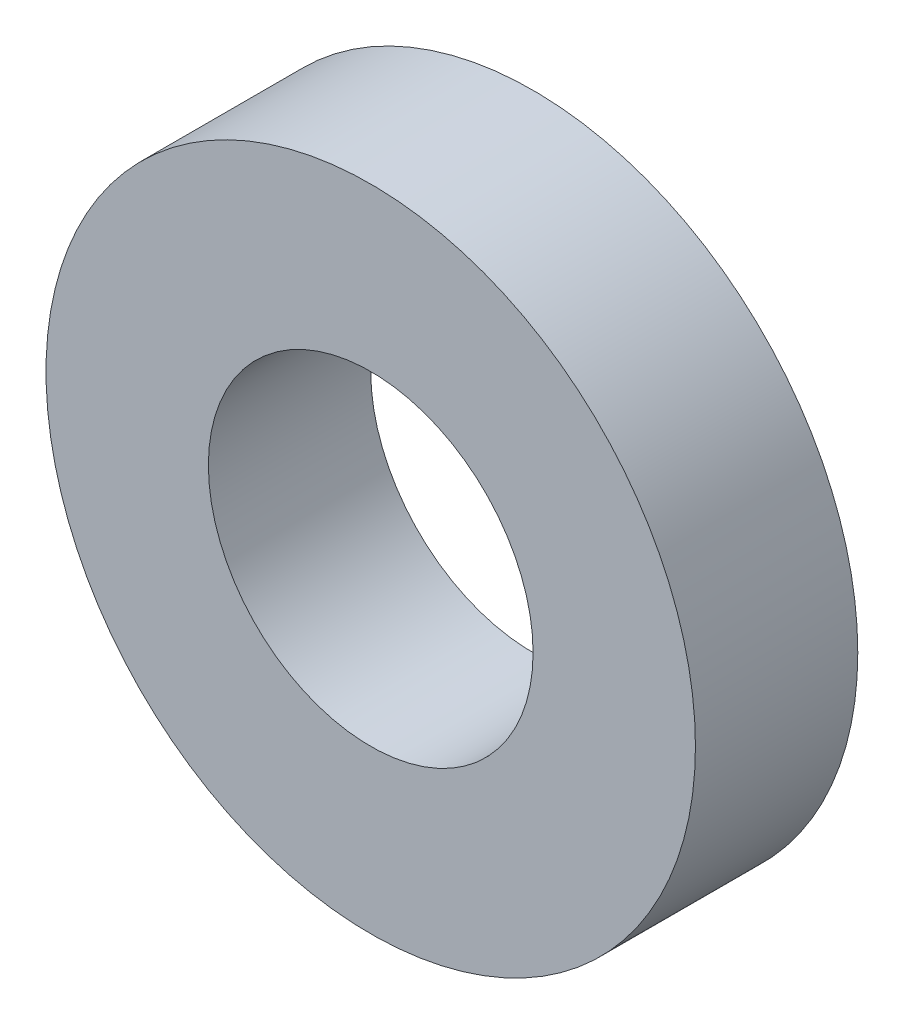
ISO-10303-21;
HEADER;
FILE_DESCRIPTION(('STEP AP214'),'2;1');
FILE_NAME('part.step','',(''),(''),'','','');
FILE_SCHEMA(('AUTOMOTIVE_DESIGN { 1 0 10303 214 1 1 1 1 }'));
ENDSEC;
DATA;
#1=APPLICATION_CONTEXT('core data for automotive mechanical design processes');
#2=APPLICATION_PROTOCOL_DEFINITION('international standard','automotive_design',2000,#1);
#3=PRODUCT_CONTEXT('',#1,'mechanical');
#4=PRODUCT('Part','Part','',(#3));
#5=PRODUCT_RELATED_PRODUCT_CATEGORY('part','',(#4));
#6=PRODUCT_DEFINITION_FORMATION('','',#4);
#7=PRODUCT_DEFINITION_CONTEXT('part definition',#1,'design');
#8=PRODUCT_DEFINITION('design','',#6,#7);
#9=PRODUCT_DEFINITION_SHAPE('','',#8);
#10=(LENGTH_UNIT() NAMED_UNIT(*) SI_UNIT(.MILLI.,.METRE.));
#11=(NAMED_UNIT(*) PLANE_ANGLE_UNIT() SI_UNIT($,.RADIAN.));
#12=(NAMED_UNIT(*) SI_UNIT($,.STERADIAN.) SOLID_ANGLE_UNIT());
#13=UNCERTAINTY_MEASURE_WITH_UNIT(LENGTH_MEASURE(1.E-05),#10,'distance_accuracy_value','');
#14=(GEOMETRIC_REPRESENTATION_CONTEXT(3) GLOBAL_UNCERTAINTY_ASSIGNED_CONTEXT((#13)) GLOBAL_UNIT_ASSIGNED_CONTEXT((#10,
#11,#12)) REPRESENTATION_CONTEXT('',''));
#15=CARTESIAN_POINT('',(0.,0.,0.));
#16=DIRECTION('',(0.,0.,1.));
#17=DIRECTION('',(1.,0.,0.));
#18=AXIS2_PLACEMENT_3D('',#15,#16,#17);
#19=CARTESIAN_POINT('',(0.,0.,2.));
#20=DIRECTION('',(0.,0.,1.));
#21=DIRECTION('',(1.,0.,0.));
#22=AXIS2_PLACEMENT_3D('',#19,#20,#21);
#23=PLANE('',#22);
#24=CARTESIAN_POINT('',(0.,0.,2.));
#25=DIRECTION('',(0.,0.,1.));
#26=DIRECTION('',(1.,0.,0.));
#27=AXIS2_PLACEMENT_3D('',#24,#25,#26);
#28=CIRCLE('',#27,8.);
#29=CARTESIAN_POINT('',(8.,0.,2.));
#30=VERTEX_POINT('',#29);
#31=EDGE_CURVE('E10',#30,#30,#28,.T.);
#32=ORIENTED_EDGE('',*,*,#31,.T.);
#33=EDGE_LOOP('',(#32));
#34=FACE_BOUND('',#33,.T.);
#35=CARTESIAN_POINT('',(0.,0.,2.));
#36=DIRECTION('',(0.,0.,1.));
#37=DIRECTION('',(1.,0.,0.));
#38=AXIS2_PLACEMENT_3D('',#35,#36,#37);
#39=CIRCLE('',#38,4.);
#40=CARTESIAN_POINT('',(4.,0.,2.));
#41=VERTEX_POINT('',#40);
#42=EDGE_CURVE('E41',#41,#41,#39,.T.);
#43=ORIENTED_EDGE('',*,*,#42,.F.);
#44=EDGE_LOOP('',(#43));
#45=FACE_BOUND('',#44,.T.);
#46=ADVANCED_FACE('F30',(#34,#45),#23,.T.);
#47=CARTESIAN_POINT('',(0.,0.,-2.));
#48=DIRECTION('',(0.,0.,1.));
#49=DIRECTION('',(1.,0.,0.));
#50=AXIS2_PLACEMENT_3D('',#47,#48,#49);
#51=PLANE('',#50);
#52=CARTESIAN_POINT('',(0.,0.,-2.));
#53=DIRECTION('',(0.,0.,1.));
#54=DIRECTION('',(1.,0.,0.));
#55=AXIS2_PLACEMENT_3D('',#52,#53,#54);
#56=CIRCLE('',#55,8.);
#57=CARTESIAN_POINT('',(8.,0.,-2.));
#58=VERTEX_POINT('',#57);
#59=EDGE_CURVE('E34',#58,#58,#56,.T.);
#60=ORIENTED_EDGE('',*,*,#59,.F.);
#61=EDGE_LOOP('',(#60));
#62=FACE_BOUND('',#61,.T.);
#63=CARTESIAN_POINT('',(0.,0.,-2.));
#64=DIRECTION('',(0.,0.,1.));
#65=DIRECTION('',(1.,0.,0.));
#66=AXIS2_PLACEMENT_3D('',#63,#64,#65);
#67=CIRCLE('',#66,4.);
#68=CARTESIAN_POINT('',(4.,0.,-2.));
#69=VERTEX_POINT('',#68);
#70=EDGE_CURVE('E43',#69,#69,#67,.T.);
#71=ORIENTED_EDGE('',*,*,#70,.T.);
#72=EDGE_LOOP('',(#71));
#73=FACE_BOUND('',#72,.T.);
#74=ADVANCED_FACE('F53',(#62,#73),#51,.F.);
#75=CARTESIAN_POINT('',(0.,0.,2.));
#76=DIRECTION('',(0.,0.,-1.));
#77=DIRECTION('',(-1.,0.,0.));
#78=AXIS2_PLACEMENT_3D('',#75,#76,#77);
#79=CYLINDRICAL_SURFACE('',#78,8.);
#80=ORIENTED_EDGE('',*,*,#31,.F.);
#81=EDGE_LOOP('',(#80));
#82=FACE_BOUND('',#81,.T.);
#83=ORIENTED_EDGE('',*,*,#59,.T.);
#84=EDGE_LOOP('',(#83));
#85=FACE_BOUND('',#84,.T.);
#86=ADVANCED_FACE('F32',(#82,#85),#79,.T.);
#87=CARTESIAN_POINT('',(0.,0.,2.));
#88=DIRECTION('',(0.,0.,-1.));
#89=DIRECTION('',(-1.,0.,0.));
#90=AXIS2_PLACEMENT_3D('',#87,#88,#89);
#91=CYLINDRICAL_SURFACE('',#90,4.);
#92=ORIENTED_EDGE('',*,*,#42,.T.);
#93=EDGE_LOOP('',(#92));
#94=FACE_BOUND('',#93,.T.);
#95=ORIENTED_EDGE('',*,*,#70,.F.);
#96=EDGE_LOOP('',(#95));
#97=FACE_BOUND('',#96,.T.);
#98=ADVANCED_FACE('F49',(#94,#97),#91,.F.);
#99=CLOSED_SHELL('',(#46,#74,#86,#98));
#100=MANIFOLD_SOLID_BREP('B2',#99);
#101=ADVANCED_BREP_SHAPE_REPRESENTATION('',(#18,#100),#14);
#102=SHAPE_DEFINITION_REPRESENTATION(#9,#101);
ENDSEC;
END-ISO-10303-21;
